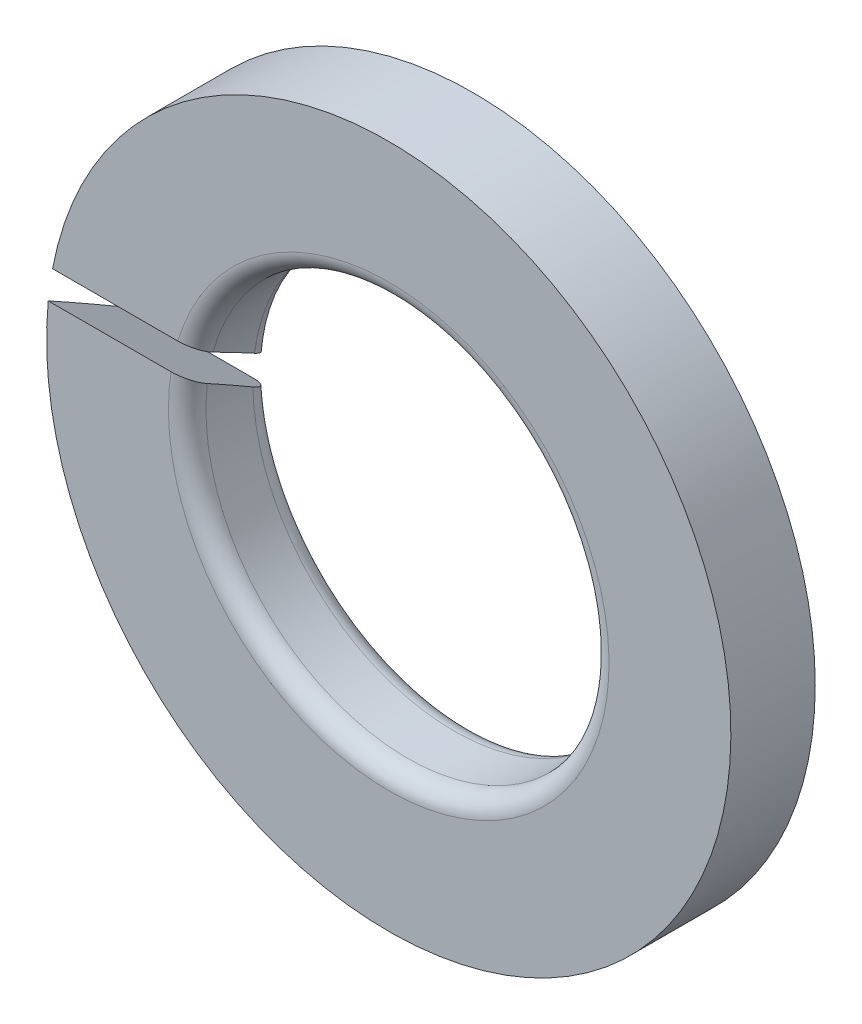
ISO-10303-21;
HEADER;
FILE_DESCRIPTION(('STEP AP214'),'2;1');
FILE_NAME('part.step','',(''),(''),'','','');
FILE_SCHEMA(('AUTOMOTIVE_DESIGN { 1 0 10303 214 1 1 1 1 }'));
ENDSEC;
DATA;
#1=APPLICATION_CONTEXT('core data for automotive mechanical design processes');
#2=APPLICATION_PROTOCOL_DEFINITION('international standard','automotive_design',2000,#1);
#3=PRODUCT_CONTEXT('',#1,'mechanical');
#4=PRODUCT('Part','Part','',(#3));
#5=PRODUCT_RELATED_PRODUCT_CATEGORY('part','',(#4));
#6=PRODUCT_DEFINITION_FORMATION('','',#4);
#7=PRODUCT_DEFINITION_CONTEXT('part definition',#1,'design');
#8=PRODUCT_DEFINITION('design','',#6,#7);
#9=PRODUCT_DEFINITION_SHAPE('','',#8);
#10=(LENGTH_UNIT() NAMED_UNIT(*) SI_UNIT(.MILLI.,.METRE.));
#11=(NAMED_UNIT(*) PLANE_ANGLE_UNIT() SI_UNIT($,.RADIAN.));
#12=(NAMED_UNIT(*) SI_UNIT($,.STERADIAN.) SOLID_ANGLE_UNIT());
#13=UNCERTAINTY_MEASURE_WITH_UNIT(LENGTH_MEASURE(1.E-05),#10,'distance_accuracy_value','');
#14=(GEOMETRIC_REPRESENTATION_CONTEXT(3) GLOBAL_UNCERTAINTY_ASSIGNED_CONTEXT((#13)) GLOBAL_UNIT_ASSIGNED_CONTEXT((#10,
#11,#12)) REPRESENTATION_CONTEXT('',''));
#15=CARTESIAN_POINT('',(0.,0.,0.));
#16=DIRECTION('',(0.,0.,1.));
#17=DIRECTION('',(1.,0.,0.));
#18=AXIS2_PLACEMENT_3D('',#15,#16,#17);
#19=CARTESIAN_POINT('',(-1.075,0.16,0.));
#20=DIRECTION('',(0.,0.866025403784439,-0.5));
#21=DIRECTION('',(-1.,0.,0.));
#22=AXIS2_PLACEMENT_3D('',#19,#20,#21);
#23=PLANE('',#22);
#24=CARTESIAN_POINT('',(0.,0.,-0.27712812921102));
#25=DIRECTION('',(0.,-0.866025403784439,0.5));
#26=DIRECTION('',(0.,-0.5,-0.866025403784439));
#27=AXIS2_PLACEMENT_3D('',#24,#25,#26);
#28=ELLIPSE('',#27,7.3,3.65);
#29=CARTESIAN_POINT('',(-3.58617109498047,0.679615242270663,0.9));
#30=VERTEX_POINT('',#29);
#31=CARTESIAN_POINT('',(-3.64649146440794,0.16,0.));
#32=VERTEX_POINT('',#31);
#33=EDGE_CURVE('E239',#30,#32,#28,.T.);
#34=ORIENTED_EDGE('',*,*,#33,.T.);
#35=DIRECTION('',(-1.,0.,0.));
#36=VECTOR('',#35,1.);
#37=CARTESIAN_POINT('',(-1.075,0.16,0.));
#38=LINE('',#37,#36);
#39=CARTESIAN_POINT('',(-2.34454686453481,0.16,0.));
#40=VERTEX_POINT('',#39);
#41=EDGE_CURVE('E198',#40,#32,#38,.T.);
#42=ORIENTED_EDGE('',*,*,#41,.F.);
#43=CARTESIAN_POINT('',(-2.34454686453481,0.16,0.));
#44=CARTESIAN_POINT('',(-2.30284654483364,0.16,0.));
#45=CARTESIAN_POINT('',(-2.26202930823946,0.170207375777639,0.0176796934588181));
#46=CARTESIAN_POINT('',(-2.22441311936851,0.179614249127397,0.0339728760409649));
#47=CARTESIAN_POINT('',(-2.19479199391979,0.196801226882786,0.0637415947418553));
#48=CARTESIAN_POINT('',(-2.13820078337379,0.229636977114115,0.120614782447158));
#49=CARTESIAN_POINT('',(-2.1322795898407,0.27547005383323,0.199999999991868));
#50=B_SPLINE_CURVE_WITH_KNOTS('',2,(#43,#44,#45,#46,#47,#48,#49),.UNSPECIFIED.,.F.,.F.,(3,2,2,
3),(0.,0.25,0.5,1.),.UNSPECIFIED.);
#51=CARTESIAN_POINT('',(-2.13227958988462,0.275470053837926,0.2));
#52=VERTEX_POINT('',#51);
#53=EDGE_CURVE('E100',#40,#52,#50,.T.);
#54=ORIENTED_EDGE('',*,*,#53,.T.);
#55=CARTESIAN_POINT('',(0.,0.,-0.27712812921102));
#56=DIRECTION('',(0.,0.866025403784439,-0.5));
#57=DIRECTION('',(0.,-0.5,-0.866025403784439));
#58=AXIS2_PLACEMENT_3D('',#55,#56,#57);
#59=ELLIPSE('',#58,4.3,2.15);
#60=CARTESIAN_POINT('',(-2.07466628795288,0.564145188432738,0.7));
#61=VERTEX_POINT('',#60);
#62=EDGE_CURVE('E196',#52,#61,#59,.T.);
#63=ORIENTED_EDGE('',*,*,#62,.T.);
#64=CARTESIAN_POINT('',(-2.07466628795288,0.564145188432738,0.7));
#65=CARTESIAN_POINT('',(-2.06224424890784,0.609827729315507,0.779124481827798));
#66=CARTESIAN_POINT('',(-2.10827217444329,0.643186392323772,0.836903381030682));
#67=CARTESIAN_POINT('',(-2.13115035506765,0.659767315943763,0.865622383176926));
#68=CARTESIAN_POINT('',(-2.16985738858527,0.669857590186457,0.883099250827575));
#69=CARTESIAN_POINT('',(-2.20728845905892,0.679615242270663,0.9));
#70=CARTESIAN_POINT('',(-2.24958287744048,0.679615242270663,0.9));
#71=B_SPLINE_CURVE_WITH_KNOTS('',2,(#64,#65,#66,#67,#68,#69,#70),.UNSPECIFIED.,.F.,.F.,(3,2,2,
3),(0.,0.5,0.75,1.),.UNSPECIFIED.);
#72=CARTESIAN_POINT('',(-2.24958287744048,0.679615242270663,0.9));
#73=VERTEX_POINT('',#72);
#74=EDGE_CURVE('E110',#61,#73,#71,.T.);
#75=ORIENTED_EDGE('',*,*,#74,.T.);
#76=DIRECTION('',(-1.,0.,0.));
#77=VECTOR('',#76,1.);
#78=CARTESIAN_POINT('',(3.65,0.679615242270663,0.9));
#79=LINE('',#78,#77);
#80=EDGE_CURVE('E11',#73,#30,#79,.T.);
#81=ORIENTED_EDGE('',*,*,#80,.T.);
#82=EDGE_LOOP('',(#34,#42,#54,#63,#75,#81));
#83=FACE_BOUND('',#82,.T.);
#84=ADVANCED_FACE('F16',(#83),#23,.F.);
#85=CARTESIAN_POINT('',(3.65,0.,0.9));
#86=DIRECTION('',(0.,0.,1.));
#87=DIRECTION('',(0.,-1.,0.));
#88=AXIS2_PLACEMENT_3D('',#85,#86,#87);
#89=PLANE('',#88);
#90=ORIENTED_EDGE('',*,*,#80,.F.);
#91=CARTESIAN_POINT('',(0.,0.,0.9));
#92=DIRECTION('',(0.,0.,-1.));
#93=DIRECTION('',(0.,1.,0.));
#94=AXIS2_PLACEMENT_3D('',#91,#92,#93);
#95=CIRCLE('',#94,2.35);
#96=CARTESIAN_POINT('',(-2.32232144147329,0.359615242270663,0.9));
#97=VERTEX_POINT('',#96);
#98=EDGE_CURVE('E182',#73,#97,#95,.T.);
#99=ORIENTED_EDGE('',*,*,#98,.T.);
#100=DIRECTION('',(1.,0.,0.));
#101=VECTOR('',#100,1.);
#102=CARTESIAN_POINT('',(3.65,0.359615242270663,0.9));
#103=LINE('',#102,#101);
#104=CARTESIAN_POINT('',(-3.63224130221639,0.359615242270663,0.9));
#105=VERTEX_POINT('',#104);
#106=EDGE_CURVE('E158',#105,#97,#103,.T.);
#107=ORIENTED_EDGE('',*,*,#106,.F.);
#108=CARTESIAN_POINT('',(0.,0.,0.9));
#109=DIRECTION('',(0.,0.,-1.));
#110=DIRECTION('',(0.,1.,0.));
#111=AXIS2_PLACEMENT_3D('',#108,#109,#110);
#112=CIRCLE('',#111,3.65);
#113=EDGE_CURVE('E27',#30,#105,#112,.T.);
#114=ORIENTED_EDGE('',*,*,#113,.F.);
#115=EDGE_LOOP('',(#90,#99,#107,#114));
#116=FACE_BOUND('',#115,.T.);
#117=ADVANCED_FACE('F18',(#116),#89,.T.);
#118=CARTESIAN_POINT('',(0.,0.,0.));
#119=DIRECTION('',(0.,0.,-1.));
#120=DIRECTION('',(0.,1.,0.));
#121=AXIS2_PLACEMENT_3D('',#118,#119,#120);
#122=CYLINDRICAL_SURFACE('',#121,3.65);
#123=ORIENTED_EDGE('',*,*,#33,.F.);
#124=ORIENTED_EDGE('',*,*,#113,.T.);
#125=CARTESIAN_POINT('',(0.,0.,0.27712812921102));
#126=DIRECTION('',(0.,0.866025403784439,-0.5));
#127=DIRECTION('',(0.,-0.5,-0.866025403784439));
#128=AXIS2_PLACEMENT_3D('',#125,#126,#127);
#129=ELLIPSE('',#128,7.3,3.65);
#130=CARTESIAN_POINT('',(-3.64649146440794,-0.16,0.));
#131=VERTEX_POINT('',#130);
#132=EDGE_CURVE('E255',#131,#105,#129,.T.);
#133=ORIENTED_EDGE('',*,*,#132,.F.);
#134=CARTESIAN_POINT('',(0.,0.,0.));
#135=DIRECTION('',(0.,0.,-1.));
#136=DIRECTION('',(0.,1.,0.));
#137=AXIS2_PLACEMENT_3D('',#134,#135,#136);
#138=CIRCLE('',#137,3.65);
#139=EDGE_CURVE('E78',#32,#131,#138,.T.);
#140=ORIENTED_EDGE('',*,*,#139,.F.);
#141=EDGE_LOOP('',(#123,#124,#133,#140));
#142=FACE_BOUND('',#141,.T.);
#143=ADVANCED_FACE('F215',(#142),#122,.T.);
#144=CARTESIAN_POINT('',(2.35,0.,0.));
#145=DIRECTION('',(0.,0.,-1.));
#146=DIRECTION('',(0.,-1.,0.));
#147=AXIS2_PLACEMENT_3D('',#144,#145,#146);
#148=PLANE('',#147);
#149=ORIENTED_EDGE('',*,*,#139,.T.);
#150=DIRECTION('',(1.,0.,0.));
#151=VECTOR('',#150,1.);
#152=CARTESIAN_POINT('',(-4.375,-0.16,0.));
#153=LINE('',#152,#151);
#154=CARTESIAN_POINT('',(-2.34454686453481,-0.16,0.));
#155=VERTEX_POINT('',#154);
#156=EDGE_CURVE('E105',#131,#155,#153,.T.);
#157=ORIENTED_EDGE('',*,*,#156,.T.);
#158=CARTESIAN_POINT('',(0.,0.,0.));
#159=DIRECTION('',(0.,0.,-1.));
#160=DIRECTION('',(0.,1.,0.));
#161=AXIS2_PLACEMENT_3D('',#158,#159,#160);
#162=CIRCLE('',#161,2.35);
#163=EDGE_CURVE('E92',#40,#155,#162,.T.);
#164=ORIENTED_EDGE('',*,*,#163,.F.);
#165=ORIENTED_EDGE('',*,*,#41,.T.);
#166=EDGE_LOOP('',(#149,#157,#164,#165));
#167=FACE_BOUND('',#166,.T.);
#168=ADVANCED_FACE('F106',(#167),#148,.T.);
#169=CARTESIAN_POINT('',(0.,0.,0.));
#170=DIRECTION('',(0.,0.,-1.));
#171=DIRECTION('',(0.,1.,0.));
#172=AXIS2_PLACEMENT_3D('',#169,#170,#171);
#173=CYLINDRICAL_SURFACE('',#172,2.15);
#174=ORIENTED_EDGE('',*,*,#62,.F.);
#175=CARTESIAN_POINT('',(0.,0.,0.2));
#176=DIRECTION('',(0.,0.,-1.));
#177=DIRECTION('',(0.,1.,0.));
#178=AXIS2_PLACEMENT_3D('',#175,#176,#177);
#179=CIRCLE('',#178,2.15);
#180=CARTESIAN_POINT('',(-2.1495388072549,-0.0445299461620748,0.2));
#181=VERTEX_POINT('',#180);
#182=EDGE_CURVE('E103',#52,#181,#179,.T.);
#183=ORIENTED_EDGE('',*,*,#182,.T.);
#184=CARTESIAN_POINT('',(0.,0.,0.27712812921102));
#185=DIRECTION('',(0.,-0.866025403784439,0.5));
#186=DIRECTION('',(0.,-0.5,-0.866025403784439));
#187=AXIS2_PLACEMENT_3D('',#184,#185,#186);
#188=ELLIPSE('',#187,4.3,2.15);
#189=CARTESIAN_POINT('',(-2.13609295840915,0.244145188432738,0.7));
#190=VERTEX_POINT('',#189);
#191=EDGE_CURVE('E116',#190,#181,#188,.T.);
#192=ORIENTED_EDGE('',*,*,#191,.F.);
#193=CARTESIAN_POINT('',(0.,0.,0.7));
#194=DIRECTION('',(0.,0.,-1.));
#195=DIRECTION('',(0.,1.,0.));
#196=AXIS2_PLACEMENT_3D('',#193,#194,#195);
#197=CIRCLE('',#196,2.15);
#198=EDGE_CURVE('E174',#61,#190,#197,.T.);
#199=ORIENTED_EDGE('',*,*,#198,.F.);
#200=EDGE_LOOP('',(#174,#183,#192,#199));
#201=FACE_BOUND('',#200,.T.);
#202=ADVANCED_FACE('F136',(#201),#173,.F.);
#203=CARTESIAN_POINT('',(0.,0.,0.2));
#204=DIRECTION('',(0.,0.,-1.));
#205=DIRECTION('',(0.,1.,0.));
#206=AXIS2_PLACEMENT_3D('',#203,#204,#205);
#207=TOROIDAL_SURFACE('',#206,2.35,0.2);
#208=ORIENTED_EDGE('',*,*,#53,.F.);
#209=ORIENTED_EDGE('',*,*,#163,.T.);
#210=CARTESIAN_POINT('',(-2.1495388072549,-0.0445299461620748,0.2));
#211=CARTESIAN_POINT('',(-2.1486042335326,-0.0896434631876975,0.121861096403498));
#212=CARTESIAN_POINT('',(-2.19979004960379,-0.122966489857439,0.0641439211495328));
#213=CARTESIAN_POINT('',(-2.2254558171791,-0.13967543626208,0.0352031770357499));
#214=CARTESIAN_POINT('',(-2.26381764315857,-0.149824889557688,0.0176238082587095));
#215=CARTESIAN_POINT('',(-2.30227644529708,-0.16,0.));
#216=CARTESIAN_POINT('',(-2.34454686453481,-0.16,0.));
#217=B_SPLINE_CURVE_WITH_KNOTS('',2,(#210,#211,#212,#213,#214,#215,#216),.UNSPECIFIED.,.F.,.F.,
(3,2,2,3),(0.,0.5,0.75,1.),.UNSPECIFIED.);
#218=EDGE_CURVE('E96',#181,#155,#217,.T.);
#219=ORIENTED_EDGE('',*,*,#218,.F.);
#220=ORIENTED_EDGE('',*,*,#182,.F.);
#221=EDGE_LOOP('',(#208,#209,#219,#220));
#222=FACE_BOUND('',#221,.T.);
#223=ADVANCED_FACE('F93',(#222),#207,.T.);
#224=CARTESIAN_POINT('',(0.,0.,0.7));
#225=DIRECTION('',(0.,0.,-1.));
#226=DIRECTION('',(0.,1.,0.));
#227=AXIS2_PLACEMENT_3D('',#224,#225,#226);
#228=TOROIDAL_SURFACE('',#227,2.35,0.2);
#229=ORIENTED_EDGE('',*,*,#74,.F.);
#230=ORIENTED_EDGE('',*,*,#198,.T.);
#231=CARTESIAN_POINT('',(-2.32232144147329,0.359615242270694,0.900000000000054));
#232=CARTESIAN_POINT('',(-2.23496334193312,0.359615242270694,0.900000000000054));
#233=CARTESIAN_POINT('',(-2.17982220254569,0.322812638012273,0.836256019573617));
#234=CARTESIAN_POINT('',(-2.13083831057775,0.290119537884851,0.779629909095986));
#235=CARTESIAN_POINT('',(-2.13609295839893,0.244145188432961,0.700000000000386));
#236=B_SPLINE_CURVE_WITH_KNOTS('',2,(#231,#232,#233,#234,#235),.UNSPECIFIED.,.F.,.F.,(3,2,3),
(0.,0.5,1.),.UNSPECIFIED.);
#237=EDGE_CURVE('E154',#97,#190,#236,.T.);
#238=ORIENTED_EDGE('',*,*,#237,.F.);
#239=ORIENTED_EDGE('',*,*,#98,.F.);
#240=EDGE_LOOP('',(#229,#230,#238,#239));
#241=FACE_BOUND('',#240,.T.);
#242=ADVANCED_FACE('F135',(#241),#228,.T.);
#243=CARTESIAN_POINT('',(-4.375,-0.16,0.));
#244=DIRECTION('',(0.,-0.866025403784439,0.5));
#245=DIRECTION('',(-1.,0.,0.));
#246=AXIS2_PLACEMENT_3D('',#243,#244,#245);
#247=PLANE('',#246);
#248=ORIENTED_EDGE('',*,*,#132,.T.);
#249=ORIENTED_EDGE('',*,*,#106,.T.);
#250=ORIENTED_EDGE('',*,*,#237,.T.);
#251=ORIENTED_EDGE('',*,*,#191,.T.);
#252=ORIENTED_EDGE('',*,*,#218,.T.);
#253=ORIENTED_EDGE('',*,*,#156,.F.);
#254=EDGE_LOOP('',(#248,#249,#250,#251,#252,#253));
#255=FACE_BOUND('',#254,.T.);
#256=ADVANCED_FACE('F113',(#255),#247,.F.);
#257=CLOSED_SHELL('',(#84,#117,#143,#168,#202,#223,#242,#256));
#258=MANIFOLD_SOLID_BREP('B1',#257);
#259=ADVANCED_BREP_SHAPE_REPRESENTATION('',(#18,#258),#14);
#260=SHAPE_DEFINITION_REPRESENTATION(#9,#259);
ENDSEC;
END-ISO-10303-21;
